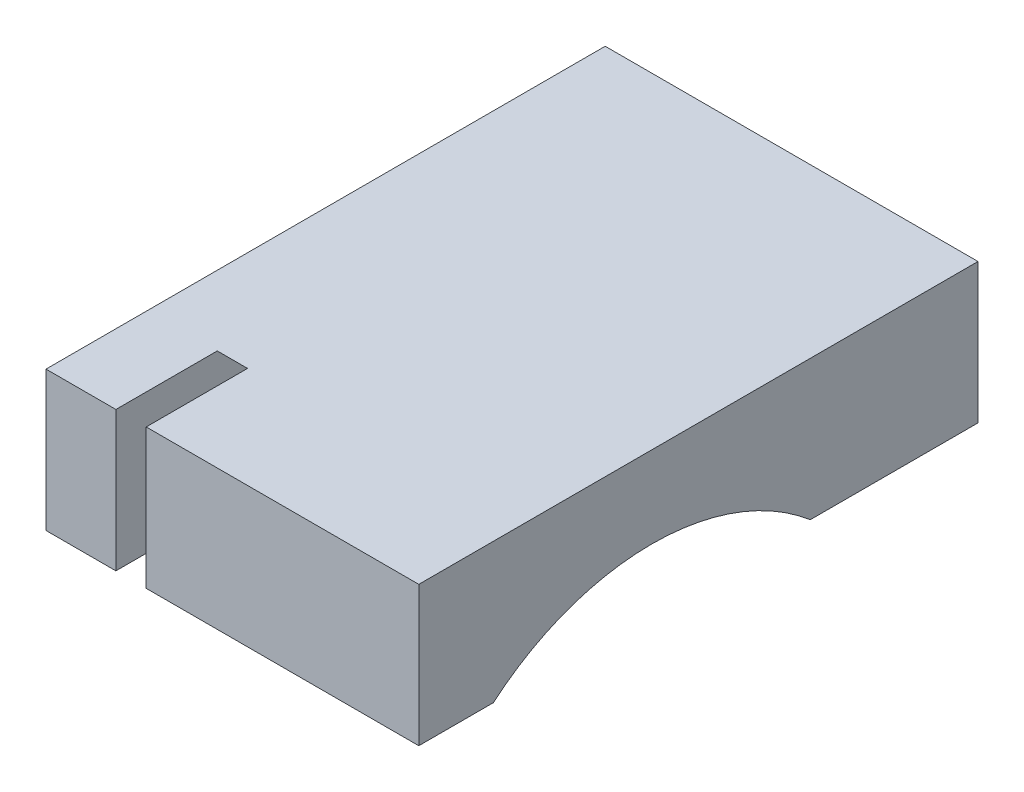
ISO-10303-21;
HEADER;
FILE_DESCRIPTION(('STEP AP214'),'2;1');
FILE_NAME('part.step','',(''),(''),'','','');
FILE_SCHEMA(('AUTOMOTIVE_DESIGN { 1 0 10303 214 1 1 1 1 }'));
ENDSEC;
DATA;
#1=APPLICATION_CONTEXT('core data for automotive mechanical design processes');
#2=APPLICATION_PROTOCOL_DEFINITION('international standard','automotive_design',2000,#1);
#3=PRODUCT_CONTEXT('',#1,'mechanical');
#4=PRODUCT('Part','Part','',(#3));
#5=PRODUCT_RELATED_PRODUCT_CATEGORY('part','',(#4));
#6=PRODUCT_DEFINITION_FORMATION('','',#4);
#7=PRODUCT_DEFINITION_CONTEXT('part definition',#1,'design');
#8=PRODUCT_DEFINITION('design','',#6,#7);
#9=PRODUCT_DEFINITION_SHAPE('','',#8);
#10=(LENGTH_UNIT() NAMED_UNIT(*) SI_UNIT(.MILLI.,.METRE.));
#11=(NAMED_UNIT(*) PLANE_ANGLE_UNIT() SI_UNIT($,.RADIAN.));
#12=(NAMED_UNIT(*) SI_UNIT($,.STERADIAN.) SOLID_ANGLE_UNIT());
#13=UNCERTAINTY_MEASURE_WITH_UNIT(LENGTH_MEASURE(1.E-05),#10,'distance_accuracy_value','');
#14=(GEOMETRIC_REPRESENTATION_CONTEXT(3) GLOBAL_UNCERTAINTY_ASSIGNED_CONTEXT((#13)) GLOBAL_UNIT_ASSIGNED_CONTEXT((#10,
#11,#12)) REPRESENTATION_CONTEXT('',''));
#15=CARTESIAN_POINT('',(0.,0.,0.));
#16=DIRECTION('',(0.,0.,1.));
#17=DIRECTION('',(1.,0.,0.));
#18=AXIS2_PLACEMENT_3D('',#15,#16,#17);
#19=CARTESIAN_POINT('',(16.,0.,0.));
#20=DIRECTION('',(0.,1.,0.));
#21=DIRECTION('',(0.,0.,1.));
#22=AXIS2_PLACEMENT_3D('',#19,#20,#21);
#23=PLANE('',#22);
#24=DIRECTION('',(0.,0.,-1.));
#25=VECTOR('',#24,1.);
#26=CARTESIAN_POINT('',(3.,0.,-31.3835626092268));
#27=LINE('',#26,#25);
#28=CARTESIAN_POINT('',(3.,0.,0.));
#29=VERTEX_POINT('',#28);
#30=CARTESIAN_POINT('',(3.,0.,-16.8007352543677));
#31=VERTEX_POINT('',#30);
#32=EDGE_CURVE('E152',#29,#31,#27,.T.);
#33=ORIENTED_EDGE('',*,*,#32,.F.);
#34=DIRECTION('',(-1.,0.,0.));
#35=VECTOR('',#34,1.);
#36=CARTESIAN_POINT('',(16.,0.,0.));
#37=LINE('',#36,#35);
#38=CARTESIAN_POINT('',(0.,0.,0.));
#39=VERTEX_POINT('',#38);
#40=EDGE_CURVE('E39',#29,#39,#37,.T.);
#41=ORIENTED_EDGE('',*,*,#40,.T.);
#42=DIRECTION('',(0.,0.,-1.));
#43=VECTOR('',#42,1.);
#44=CARTESIAN_POINT('',(0.,0.,0.));
#45=LINE('',#44,#43);
#46=CARTESIAN_POINT('',(0.,0.,-24.));
#47=VERTEX_POINT('',#46);
#48=EDGE_CURVE('E169',#39,#47,#45,.T.);
#49=ORIENTED_EDGE('',*,*,#48,.T.);
#50=DIRECTION('',(-1.,0.,0.));
#51=VECTOR('',#50,1.);
#52=CARTESIAN_POINT('',(16.,0.,-24.));
#53=LINE('',#52,#51);
#54=CARTESIAN_POINT('',(16.,0.,-24.));
#55=VERTEX_POINT('',#54);
#56=EDGE_CURVE('E178',#55,#47,#53,.T.);
#57=ORIENTED_EDGE('',*,*,#56,.F.);
#58=DIRECTION('',(0.,0.,-1.));
#59=VECTOR('',#58,1.);
#60=CARTESIAN_POINT('',(16.,0.,0.));
#61=LINE('',#60,#59);
#62=CARTESIAN_POINT('',(16.,0.,-16.8007352543677));
#63=VERTEX_POINT('',#62);
#64=EDGE_CURVE('E162',#63,#55,#61,.T.);
#65=ORIENTED_EDGE('',*,*,#64,.F.);
#66=DIRECTION('',(1.,0.,0.));
#67=VECTOR('',#66,1.);
#68=CARTESIAN_POINT('',(3.,0.,-16.8007352543677));
#69=LINE('',#68,#67);
#70=EDGE_CURVE('E46',#31,#63,#69,.T.);
#71=ORIENTED_EDGE('',*,*,#70,.F.);
#72=EDGE_LOOP('',(#33,#41,#49,#57,#65,#71));
#73=FACE_BOUND('',#72,.T.);
#74=ADVANCED_FACE('F31',(#73),#23,.F.);
#75=CARTESIAN_POINT('',(16.,0.,0.));
#76=DIRECTION('',(0.,0.,-1.));
#77=DIRECTION('',(-1.,0.,0.));
#78=AXIS2_PLACEMENT_3D('',#75,#76,#77);
#79=PLANE('',#78);
#80=DIRECTION('',(0.,1.,0.));
#81=VECTOR('',#80,1.);
#82=CARTESIAN_POINT('',(3.,3.,0.));
#83=LINE('',#82,#81);
#84=CARTESIAN_POINT('',(3.,6.,0.));
#85=VERTEX_POINT('',#84);
#86=EDGE_CURVE('E142',#29,#85,#83,.T.);
#87=ORIENTED_EDGE('',*,*,#86,.T.);
#88=DIRECTION('',(-1.,0.,0.));
#89=VECTOR('',#88,1.);
#90=CARTESIAN_POINT('',(16.,6.,0.));
#91=LINE('',#90,#89);
#92=CARTESIAN_POINT('',(0.,6.,0.));
#93=VERTEX_POINT('',#92);
#94=EDGE_CURVE('E77',#85,#93,#91,.T.);
#95=ORIENTED_EDGE('',*,*,#94,.T.);
#96=DIRECTION('',(0.,-1.,0.));
#97=VECTOR('',#96,1.);
#98=CARTESIAN_POINT('',(0.,0.,0.));
#99=LINE('',#98,#97);
#100=EDGE_CURVE('E158',#93,#39,#99,.T.);
#101=ORIENTED_EDGE('',*,*,#100,.T.);
#102=ORIENTED_EDGE('',*,*,#40,.F.);
#103=EDGE_LOOP('',(#87,#95,#101,#102));
#104=FACE_BOUND('',#103,.T.);
#105=ADVANCED_FACE('F192',(#104),#79,.F.);
#106=CARTESIAN_POINT('',(3.,-8.,-10.));
#107=DIRECTION('',(1.,0.,0.));
#108=DIRECTION('',(0.,0.,-1.));
#109=AXIS2_PLACEMENT_3D('',#106,#107,#108);
#110=CYLINDRICAL_SURFACE('',#109,10.5);
#111=CARTESIAN_POINT('',(4.3,-8.,-10.));
#112=DIRECTION('',(1.,0.,0.));
#113=DIRECTION('',(0.,0.,-1.));
#114=AXIS2_PLACEMENT_3D('',#111,#112,#113);
#115=CIRCLE('',#114,10.5);
#116=CARTESIAN_POINT('',(4.3,0.,-3.19926474563228));
#117=VERTEX_POINT('',#116);
#118=CARTESIAN_POINT('',(4.3,2.33186217250136,-11.8715298684326));
#119=VERTEX_POINT('',#118);
#120=EDGE_CURVE('E140',#117,#119,#115,.F.);
#121=ORIENTED_EDGE('',*,*,#120,.T.);
#122=DIRECTION('',(1.,0.,0.));
#123=VECTOR('',#122,1.);
#124=CARTESIAN_POINT('',(-10.301624766061,2.33186217250136,-11.8715298684326));
#125=LINE('',#124,#123);
#126=CARTESIAN_POINT('',(3.,2.33186217250136,-11.8715298684326));
#127=VERTEX_POINT('',#126);
#128=EDGE_CURVE('E126',#127,#119,#125,.T.);
#129=ORIENTED_EDGE('',*,*,#128,.F.);
#130=CARTESIAN_POINT('',(3.,-8.,-10.));
#131=DIRECTION('',(1.,0.,0.));
#132=DIRECTION('',(0.,0.,-1.));
#133=AXIS2_PLACEMENT_3D('',#130,#131,#132);
#134=CIRCLE('',#133,10.5);
#135=EDGE_CURVE('E150',#127,#31,#134,.F.);
#136=ORIENTED_EDGE('',*,*,#135,.T.);
#137=ORIENTED_EDGE('',*,*,#70,.T.);
#138=CARTESIAN_POINT('',(16.,-8.,-10.));
#139=DIRECTION('',(1.,0.,0.));
#140=DIRECTION('',(0.,0.,-1.));
#141=AXIS2_PLACEMENT_3D('',#138,#139,#140);
#142=CIRCLE('',#141,10.5);
#143=CARTESIAN_POINT('',(16.,0.,-3.19926474563228));
#144=VERTEX_POINT('',#143);
#145=EDGE_CURVE('E148',#144,#63,#142,.F.);
#146=ORIENTED_EDGE('',*,*,#145,.F.);
#147=DIRECTION('',(1.,0.,0.));
#148=VECTOR('',#147,1.);
#149=CARTESIAN_POINT('',(3.,0.,-3.19926474563228));
#150=LINE('',#149,#148);
#151=EDGE_CURVE('E155',#117,#144,#150,.T.);
#152=ORIENTED_EDGE('',*,*,#151,.F.);
#153=EDGE_LOOP('',(#121,#129,#136,#137,#146,#152));
#154=FACE_BOUND('',#153,.T.);
#155=ADVANCED_FACE('F194',(#154),#110,.F.);
#156=CARTESIAN_POINT('',(16.,0.,0.));
#157=VERTEX_POINT('',#156);
#158=CARTESIAN_POINT('',(4.3,0.,0.));
#159=VERTEX_POINT('',#158);
#160=EDGE_CURVE('E11',#157,#159,#37,.T.);
#161=ORIENTED_EDGE('',*,*,#160,.T.);
#162=DIRECTION('',(0.,0.,-1.));
#163=VECTOR('',#162,1.);
#164=CARTESIAN_POINT('',(4.3,0.,-31.3835626092268));
#165=LINE('',#164,#163);
#166=EDGE_CURVE('E144',#159,#117,#165,.T.);
#167=ORIENTED_EDGE('',*,*,#166,.T.);
#168=ORIENTED_EDGE('',*,*,#151,.T.);
#169=EDGE_CURVE('E84',#157,#144,#61,.T.);
#170=ORIENTED_EDGE('',*,*,#169,.F.);
#171=EDGE_LOOP('',(#161,#167,#168,#170));
#172=FACE_BOUND('',#171,.T.);
#173=ADVANCED_FACE('F199',(#172),#23,.F.);
#174=CARTESIAN_POINT('',(16.,6.,0.));
#175=DIRECTION('',(-1.,0.,0.));
#176=DIRECTION('',(0.,0.,1.));
#177=AXIS2_PLACEMENT_3D('',#174,#175,#176);
#178=PLANE('',#177);
#179=ORIENTED_EDGE('',*,*,#145,.T.);
#180=ORIENTED_EDGE('',*,*,#64,.T.);
#181=DIRECTION('',(0.,1.,0.));
#182=VECTOR('',#181,1.);
#183=CARTESIAN_POINT('',(16.,0.,-24.));
#184=LINE('',#183,#182);
#185=CARTESIAN_POINT('',(16.,6.,-24.));
#186=VERTEX_POINT('',#185);
#187=EDGE_CURVE('E165',#55,#186,#184,.T.);
#188=ORIENTED_EDGE('',*,*,#187,.T.);
#189=DIRECTION('',(0.,0.,1.));
#190=VECTOR('',#189,1.);
#191=CARTESIAN_POINT('',(16.,6.,0.));
#192=LINE('',#191,#190);
#193=CARTESIAN_POINT('',(16.,6.,0.));
#194=VERTEX_POINT('',#193);
#195=EDGE_CURVE('E55',#186,#194,#192,.T.);
#196=ORIENTED_EDGE('',*,*,#195,.T.);
#197=DIRECTION('',(0.,-1.,0.));
#198=VECTOR('',#197,1.);
#199=CARTESIAN_POINT('',(16.,0.,0.));
#200=LINE('',#199,#198);
#201=EDGE_CURVE('E160',#194,#157,#200,.T.);
#202=ORIENTED_EDGE('',*,*,#201,.T.);
#203=ORIENTED_EDGE('',*,*,#169,.T.);
#204=EDGE_LOOP('',(#179,#180,#188,#196,#202,#203));
#205=FACE_BOUND('',#204,.T.);
#206=ADVANCED_FACE('F203',(#205),#178,.F.);
#207=CARTESIAN_POINT('',(4.3,6.,0.));
#208=VERTEX_POINT('',#207);
#209=EDGE_CURVE('E174',#194,#208,#91,.T.);
#210=ORIENTED_EDGE('',*,*,#209,.T.);
#211=DIRECTION('',(0.,-1.,0.));
#212=VECTOR('',#211,1.);
#213=CARTESIAN_POINT('',(4.3,3.,0.));
#214=LINE('',#213,#212);
#215=EDGE_CURVE('E134',#208,#159,#214,.T.);
#216=ORIENTED_EDGE('',*,*,#215,.T.);
#217=ORIENTED_EDGE('',*,*,#160,.F.);
#218=ORIENTED_EDGE('',*,*,#201,.F.);
#219=EDGE_LOOP('',(#210,#216,#217,#218));
#220=FACE_BOUND('',#219,.T.);
#221=ADVANCED_FACE('F33',(#220),#79,.F.);
#222=CARTESIAN_POINT('',(16.,0.,-24.));
#223=DIRECTION('',(0.,0.,1.));
#224=DIRECTION('',(1.,0.,0.));
#225=AXIS2_PLACEMENT_3D('',#222,#223,#224);
#226=PLANE('',#225);
#227=DIRECTION('',(0.,1.,0.));
#228=VECTOR('',#227,1.);
#229=CARTESIAN_POINT('',(0.,0.,-24.));
#230=LINE('',#229,#228);
#231=CARTESIAN_POINT('',(0.,6.,-24.));
#232=VERTEX_POINT('',#231);
#233=EDGE_CURVE('E171',#47,#232,#230,.T.);
#234=ORIENTED_EDGE('',*,*,#233,.T.);
#235=DIRECTION('',(-1.,0.,0.));
#236=VECTOR('',#235,1.);
#237=CARTESIAN_POINT('',(16.,6.,-24.));
#238=LINE('',#237,#236);
#239=EDGE_CURVE('E176',#186,#232,#238,.T.);
#240=ORIENTED_EDGE('',*,*,#239,.F.);
#241=ORIENTED_EDGE('',*,*,#187,.F.);
#242=ORIENTED_EDGE('',*,*,#56,.T.);
#243=EDGE_LOOP('',(#234,#240,#241,#242));
#244=FACE_BOUND('',#243,.T.);
#245=ADVANCED_FACE('F202',(#244),#226,.F.);
#246=CARTESIAN_POINT('',(16.,6.,0.));
#247=DIRECTION('',(0.,-1.,0.));
#248=DIRECTION('',(0.,0.,-1.));
#249=AXIS2_PLACEMENT_3D('',#246,#247,#248);
#250=PLANE('',#249);
#251=DIRECTION('',(1.,0.,0.));
#252=VECTOR('',#251,1.);
#253=CARTESIAN_POINT('',(-10.301624766061,6.,-4.35073278926971));
#254=LINE('',#253,#252);
#255=CARTESIAN_POINT('',(3.,6.,-4.35073278926971));
#256=VERTEX_POINT('',#255);
#257=CARTESIAN_POINT('',(4.3,6.,-4.35073278926971));
#258=VERTEX_POINT('',#257);
#259=EDGE_CURVE('E123',#256,#258,#254,.T.);
#260=ORIENTED_EDGE('',*,*,#259,.T.);
#261=DIRECTION('',(0.,0.,1.));
#262=VECTOR('',#261,1.);
#263=CARTESIAN_POINT('',(4.3,6.,-31.3835626092268));
#264=LINE('',#263,#262);
#265=EDGE_CURVE('E129',#258,#208,#264,.T.);
#266=ORIENTED_EDGE('',*,*,#265,.T.);
#267=ORIENTED_EDGE('',*,*,#209,.F.);
#268=ORIENTED_EDGE('',*,*,#195,.F.);
#269=ORIENTED_EDGE('',*,*,#239,.T.);
#270=DIRECTION('',(0.,0.,1.));
#271=VECTOR('',#270,1.);
#272=CARTESIAN_POINT('',(0.,6.,0.));
#273=LINE('',#272,#271);
#274=EDGE_CURVE('E163',#232,#93,#273,.T.);
#275=ORIENTED_EDGE('',*,*,#274,.T.);
#276=ORIENTED_EDGE('',*,*,#94,.F.);
#277=DIRECTION('',(0.,0.,-1.));
#278=VECTOR('',#277,1.);
#279=CARTESIAN_POINT('',(3.,6.,-31.3835626092268));
#280=LINE('',#279,#278);
#281=EDGE_CURVE('E139',#85,#256,#280,.T.);
#282=ORIENTED_EDGE('',*,*,#281,.T.);
#283=EDGE_LOOP('',(#260,#266,#267,#268,#269,#275,#276,#282));
#284=FACE_BOUND('',#283,.T.);
#285=ADVANCED_FACE('F138',(#284),#250,.F.);
#286=CARTESIAN_POINT('',(0.,6.,0.));
#287=DIRECTION('',(-1.,0.,0.));
#288=DIRECTION('',(0.,0.,1.));
#289=AXIS2_PLACEMENT_3D('',#286,#287,#288);
#290=PLANE('',#289);
#291=ORIENTED_EDGE('',*,*,#100,.F.);
#292=ORIENTED_EDGE('',*,*,#274,.F.);
#293=ORIENTED_EDGE('',*,*,#233,.F.);
#294=ORIENTED_EDGE('',*,*,#48,.F.);
#295=EDGE_LOOP('',(#291,#292,#293,#294));
#296=FACE_BOUND('',#295,.T.);
#297=ADVANCED_FACE('F190',(#296),#290,.T.);
#298=CARTESIAN_POINT('',(3.,3.,-31.3835626092268));
#299=DIRECTION('',(1.,0.,0.));
#300=DIRECTION('',(0.,0.,-1.));
#301=AXIS2_PLACEMENT_3D('',#298,#299,#300);
#302=PLANE('',#301);
#303=ORIENTED_EDGE('',*,*,#135,.F.);
#304=DIRECTION('',(0.,0.438371146789072,0.89879404629917));
#305=VECTOR('',#304,1.);
#306=CARTESIAN_POINT('',(3.,-5.22758808628472,-27.3706997742496));
#307=LINE('',#306,#305);
#308=EDGE_CURVE('E149',#127,#256,#307,.T.);
#309=ORIENTED_EDGE('',*,*,#308,.T.);
#310=ORIENTED_EDGE('',*,*,#281,.F.);
#311=ORIENTED_EDGE('',*,*,#86,.F.);
#312=ORIENTED_EDGE('',*,*,#32,.T.);
#313=EDGE_LOOP('',(#303,#309,#310,#311,#312));
#314=FACE_BOUND('',#313,.T.);
#315=ADVANCED_FACE('F223',(#314),#302,.T.);
#316=CARTESIAN_POINT('',(-10.301624766061,-5.22758808628472,-27.3706997742496));
#317=DIRECTION('',(0.,-0.89879404629917,0.438371146789072));
#318=DIRECTION('',(0.,-0.438371146789072,-0.89879404629917));
#319=AXIS2_PLACEMENT_3D('',#316,#317,#318);
#320=PLANE('',#319);
#321=ORIENTED_EDGE('',*,*,#128,.T.);
#322=DIRECTION('',(0.,-0.438371146789072,-0.89879404629917));
#323=VECTOR('',#322,1.);
#324=CARTESIAN_POINT('',(4.3,-5.22758808628472,-27.3706997742496));
#325=LINE('',#324,#323);
#326=EDGE_CURVE('E119',#258,#119,#325,.T.);
#327=ORIENTED_EDGE('',*,*,#326,.F.);
#328=ORIENTED_EDGE('',*,*,#259,.F.);
#329=ORIENTED_EDGE('',*,*,#308,.F.);
#330=EDGE_LOOP('',(#321,#327,#328,#329));
#331=FACE_BOUND('',#330,.T.);
#332=ADVANCED_FACE('F121',(#331),#320,.T.);
#333=CARTESIAN_POINT('',(4.3,3.,-31.3835626092268));
#334=DIRECTION('',(1.,0.,0.));
#335=DIRECTION('',(0.,0.,-1.));
#336=AXIS2_PLACEMENT_3D('',#333,#334,#335);
#337=PLANE('',#336);
#338=ORIENTED_EDGE('',*,*,#326,.T.);
#339=ORIENTED_EDGE('',*,*,#120,.F.);
#340=ORIENTED_EDGE('',*,*,#166,.F.);
#341=ORIENTED_EDGE('',*,*,#215,.F.);
#342=ORIENTED_EDGE('',*,*,#265,.F.);
#343=EDGE_LOOP('',(#338,#339,#340,#341,#342));
#344=FACE_BOUND('',#343,.T.);
#345=ADVANCED_FACE('F132',(#344),#337,.F.);
#346=CLOSED_SHELL('',(#74,#105,#155,#173,#206,#221,#245,#285,#297,#315,#332,#345));
#347=MANIFOLD_SOLID_BREP('B2',#346);
#348=ADVANCED_BREP_SHAPE_REPRESENTATION('',(#18,#347),#14);
#349=SHAPE_DEFINITION_REPRESENTATION(#9,#348);
ENDSEC;
END-ISO-10303-21;
